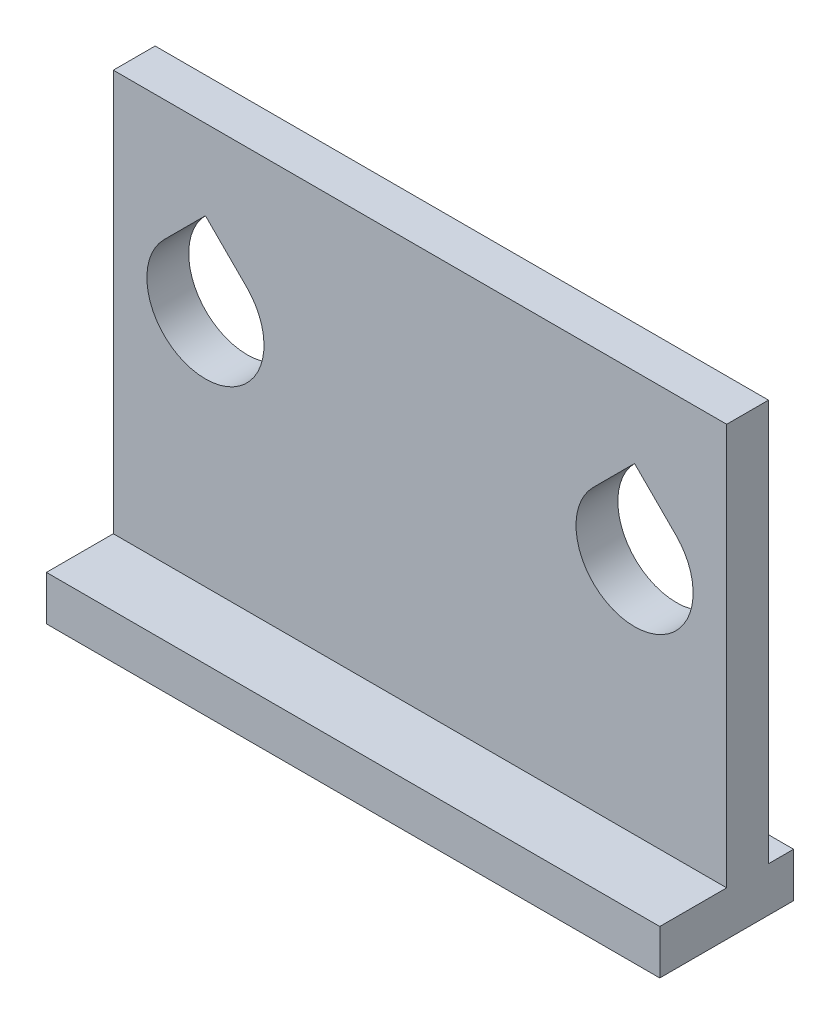
ISO-10303-21;
HEADER;
FILE_DESCRIPTION(('STEP AP214'),'2;1');
FILE_NAME('part.step','',(''),(''),'','','');
FILE_SCHEMA(('AUTOMOTIVE_DESIGN { 1 0 10303 214 1 1 1 1 }'));
ENDSEC;
DATA;
#1=APPLICATION_CONTEXT('core data for automotive mechanical design processes');
#2=APPLICATION_PROTOCOL_DEFINITION('international standard','automotive_design',2000,#1);
#3=PRODUCT_CONTEXT('',#1,'mechanical');
#4=PRODUCT('Part','Part','',(#3));
#5=PRODUCT_RELATED_PRODUCT_CATEGORY('part','',(#4));
#6=PRODUCT_DEFINITION_FORMATION('','',#4);
#7=PRODUCT_DEFINITION_CONTEXT('part definition',#1,'design');
#8=PRODUCT_DEFINITION('design','',#6,#7);
#9=PRODUCT_DEFINITION_SHAPE('','',#8);
#10=(LENGTH_UNIT() NAMED_UNIT(*) SI_UNIT(.MILLI.,.METRE.));
#11=(NAMED_UNIT(*) PLANE_ANGLE_UNIT() SI_UNIT($,.RADIAN.));
#12=(NAMED_UNIT(*) SI_UNIT($,.STERADIAN.) SOLID_ANGLE_UNIT());
#13=UNCERTAINTY_MEASURE_WITH_UNIT(LENGTH_MEASURE(1.E-05),#10,'distance_accuracy_value','');
#14=(GEOMETRIC_REPRESENTATION_CONTEXT(3) GLOBAL_UNCERTAINTY_ASSIGNED_CONTEXT((#13)) GLOBAL_UNIT_ASSIGNED_CONTEXT((#10,
#11,#12)) REPRESENTATION_CONTEXT('',''));
#15=CARTESIAN_POINT('',(0.,0.,0.));
#16=DIRECTION('',(0.,0.,1.));
#17=DIRECTION('',(1.,0.,0.));
#18=AXIS2_PLACEMENT_3D('',#15,#16,#17);
#19=CARTESIAN_POINT('',(0.,0.,7.5));
#20=DIRECTION('',(0.,1.,0.));
#21=DIRECTION('',(-1.,0.,0.));
#22=AXIS2_PLACEMENT_3D('',#19,#20,#21);
#23=PLANE('',#22);
#24=DIRECTION('',(0.,0.,-1.));
#25=VECTOR('',#24,1.);
#26=CARTESIAN_POINT('',(-55.,0.,7.5));
#27=LINE('',#26,#25);
#28=CARTESIAN_POINT('',(-55.,0.,19.5));
#29=VERTEX_POINT('',#28);
#30=CARTESIAN_POINT('',(-55.,0.,-4.5));
#31=VERTEX_POINT('',#30);
#32=EDGE_CURVE('E135',#29,#31,#27,.T.);
#33=ORIENTED_EDGE('',*,*,#32,.T.);
#34=DIRECTION('',(1.,0.,0.));
#35=VECTOR('',#34,1.);
#36=CARTESIAN_POINT('',(-55.,0.,-4.5));
#37=LINE('',#36,#35);
#38=CARTESIAN_POINT('',(55.,0.,-4.5));
#39=VERTEX_POINT('',#38);
#40=EDGE_CURVE('E166',#31,#39,#37,.T.);
#41=ORIENTED_EDGE('',*,*,#40,.T.);
#42=DIRECTION('',(0.,0.,-1.));
#43=VECTOR('',#42,1.);
#44=CARTESIAN_POINT('',(55.,0.,7.5));
#45=LINE('',#44,#43);
#46=CARTESIAN_POINT('',(55.,0.,19.5));
#47=VERTEX_POINT('',#46);
#48=EDGE_CURVE('E44',#47,#39,#45,.T.);
#49=ORIENTED_EDGE('',*,*,#48,.F.);
#50=DIRECTION('',(1.,0.,0.));
#51=VECTOR('',#50,1.);
#52=CARTESIAN_POINT('',(-55.,0.,19.5));
#53=LINE('',#52,#51);
#54=EDGE_CURVE('E151',#29,#47,#53,.T.);
#55=ORIENTED_EDGE('',*,*,#54,.F.);
#56=EDGE_LOOP('',(#33,#41,#49,#55));
#57=FACE_BOUND('',#56,.T.);
#58=ADVANCED_FACE('F36',(#57),#23,.F.);
#59=CARTESIAN_POINT('',(55.,0.,7.5));
#60=DIRECTION('',(-1.,0.,0.));
#61=DIRECTION('',(0.,0.,1.));
#62=AXIS2_PLACEMENT_3D('',#59,#60,#61);
#63=PLANE('',#62);
#64=DIRECTION('',(0.,1.,0.));
#65=VECTOR('',#64,1.);
#66=CARTESIAN_POINT('',(55.,0.,7.5));
#67=LINE('',#66,#65);
#68=CARTESIAN_POINT('',(55.,8.,7.5));
#69=VERTEX_POINT('',#68);
#70=CARTESIAN_POINT('',(55.,80.,7.5));
#71=VERTEX_POINT('',#70);
#72=EDGE_CURVE('E199',#69,#71,#67,.T.);
#73=ORIENTED_EDGE('',*,*,#72,.F.);
#74=DIRECTION('',(0.,0.,1.));
#75=VECTOR('',#74,1.);
#76=CARTESIAN_POINT('',(55.,8.,-4.5));
#77=LINE('',#76,#75);
#78=CARTESIAN_POINT('',(55.,8.,19.5));
#79=VERTEX_POINT('',#78);
#80=EDGE_CURVE('E174',#69,#79,#77,.T.);
#81=ORIENTED_EDGE('',*,*,#80,.T.);
#82=DIRECTION('',(0.,1.,0.));
#83=VECTOR('',#82,1.);
#84=CARTESIAN_POINT('',(55.,0.,19.5));
#85=LINE('',#84,#83);
#86=EDGE_CURVE('E155',#47,#79,#85,.T.);
#87=ORIENTED_EDGE('',*,*,#86,.F.);
#88=ORIENTED_EDGE('',*,*,#48,.T.);
#89=DIRECTION('',(0.,1.,0.));
#90=VECTOR('',#89,1.);
#91=CARTESIAN_POINT('',(55.,0.,-4.5));
#92=LINE('',#91,#90);
#93=CARTESIAN_POINT('',(55.,8.,-4.5));
#94=VERTEX_POINT('',#93);
#95=EDGE_CURVE('E168',#39,#94,#92,.T.);
#96=ORIENTED_EDGE('',*,*,#95,.T.);
#97=CARTESIAN_POINT('',(55.,8.,0.));
#98=VERTEX_POINT('',#97);
#99=EDGE_CURVE('E178',#94,#98,#77,.T.);
#100=ORIENTED_EDGE('',*,*,#99,.T.);
#101=DIRECTION('',(0.,1.,0.));
#102=VECTOR('',#101,1.);
#103=CARTESIAN_POINT('',(55.,0.,0.));
#104=LINE('',#103,#102);
#105=CARTESIAN_POINT('',(55.,80.,0.));
#106=VERTEX_POINT('',#105);
#107=EDGE_CURVE('E222',#98,#106,#104,.T.);
#108=ORIENTED_EDGE('',*,*,#107,.T.);
#109=DIRECTION('',(0.,0.,-1.));
#110=VECTOR('',#109,1.);
#111=CARTESIAN_POINT('',(55.,80.,7.5));
#112=LINE('',#111,#110);
#113=EDGE_CURVE('E230',#71,#106,#112,.T.);
#114=ORIENTED_EDGE('',*,*,#113,.F.);
#115=EDGE_LOOP('',(#73,#81,#87,#88,#96,#100,#108,#114));
#116=FACE_BOUND('',#115,.T.);
#117=ADVANCED_FACE('F285',(#116),#63,.F.);
#118=CARTESIAN_POINT('',(0.,80.,7.5));
#119=DIRECTION('',(0.,1.,0.));
#120=DIRECTION('',(-1.,0.,0.));
#121=AXIS2_PLACEMENT_3D('',#118,#119,#120);
#122=PLANE('',#121);
#123=DIRECTION('',(1.,0.,0.));
#124=VECTOR('',#123,1.);
#125=CARTESIAN_POINT('',(0.,80.,0.));
#126=LINE('',#125,#124);
#127=CARTESIAN_POINT('',(-55.,80.,0.));
#128=VERTEX_POINT('',#127);
#129=EDGE_CURVE('E224',#128,#106,#126,.T.);
#130=ORIENTED_EDGE('',*,*,#129,.F.);
#131=DIRECTION('',(0.,0.,-1.));
#132=VECTOR('',#131,1.);
#133=CARTESIAN_POINT('',(-55.,80.,7.5));
#134=LINE('',#133,#132);
#135=CARTESIAN_POINT('',(-55.,80.,7.5));
#136=VERTEX_POINT('',#135);
#137=EDGE_CURVE('E147',#136,#128,#134,.T.);
#138=ORIENTED_EDGE('',*,*,#137,.F.);
#139=DIRECTION('',(1.,0.,0.));
#140=VECTOR('',#139,1.);
#141=CARTESIAN_POINT('',(0.,80.,7.5));
#142=LINE('',#141,#140);
#143=EDGE_CURVE('E201',#136,#71,#142,.T.);
#144=ORIENTED_EDGE('',*,*,#143,.T.);
#145=ORIENTED_EDGE('',*,*,#113,.T.);
#146=EDGE_LOOP('',(#130,#138,#144,#145));
#147=FACE_BOUND('',#146,.T.);
#148=ADVANCED_FACE('F287',(#147),#122,.T.);
#149=CARTESIAN_POINT('',(-38.481,50.8,7.5));
#150=DIRECTION('',(0.,0.,-1.));
#151=DIRECTION('',(-1.,0.,0.));
#152=AXIS2_PLACEMENT_3D('',#149,#150,#151);
#153=CYLINDRICAL_SURFACE('',#152,10.5);
#154=CARTESIAN_POINT('',(-38.481,50.8,0.));
#155=DIRECTION('',(0.,0.,1.));
#156=DIRECTION('',(1.,0.,0.));
#157=AXIS2_PLACEMENT_3D('',#154,#155,#156);
#158=CIRCLE('',#157,10.5);
#159=CARTESIAN_POINT('',(-45.9056212024588,58.2246212024587,0.));
#160=VERTEX_POINT('',#159);
#161=CARTESIAN_POINT('',(-31.0563787975412,58.2246212024587,0.));
#162=VERTEX_POINT('',#161);
#163=EDGE_CURVE('E213',#160,#162,#158,.T.);
#164=ORIENTED_EDGE('',*,*,#163,.F.);
#165=DIRECTION('',(0.,0.,-1.));
#166=VECTOR('',#165,1.);
#167=CARTESIAN_POINT('',(-45.9056212024588,58.2246212024587,7.5));
#168=LINE('',#167,#166);
#169=CARTESIAN_POINT('',(-45.9056212024588,58.2246212024587,7.5));
#170=VERTEX_POINT('',#169);
#171=EDGE_CURVE('E148',#170,#160,#168,.T.);
#172=ORIENTED_EDGE('',*,*,#171,.F.);
#173=CARTESIAN_POINT('',(-38.481,50.8,7.5));
#174=DIRECTION('',(0.,0.,1.));
#175=DIRECTION('',(1.,0.,0.));
#176=AXIS2_PLACEMENT_3D('',#173,#174,#175);
#177=CIRCLE('',#176,10.5);
#178=CARTESIAN_POINT('',(-31.0563787975412,58.2246212024587,7.5));
#179=VERTEX_POINT('',#178);
#180=EDGE_CURVE('E191',#170,#179,#177,.T.);
#181=ORIENTED_EDGE('',*,*,#180,.T.);
#182=DIRECTION('',(0.,0.,-1.));
#183=VECTOR('',#182,1.);
#184=CARTESIAN_POINT('',(-31.0563787975412,58.2246212024587,7.5));
#185=LINE('',#184,#183);
#186=EDGE_CURVE('E234',#179,#162,#185,.T.);
#187=ORIENTED_EDGE('',*,*,#186,.T.);
#188=EDGE_LOOP('',(#164,#172,#181,#187));
#189=FACE_BOUND('',#188,.T.);
#190=ADVANCED_FACE('F271',(#189),#153,.F.);
#191=CARTESIAN_POINT('',(-52.0651212024589,52.0651212024586,7.5));
#192=DIRECTION('',(-0.707106781186549,0.707106781186546,0.));
#193=DIRECTION('',(-0.707106781186546,-0.707106781186549,0.));
#194=AXIS2_PLACEMENT_3D('',#191,#192,#193);
#195=PLANE('',#194);
#196=DIRECTION('',(0.707106781186546,0.707106781186549,0.));
#197=VECTOR('',#196,1.);
#198=CARTESIAN_POINT('',(-52.0651212024589,52.0651212024586,0.));
#199=LINE('',#198,#197);
#200=CARTESIAN_POINT('',(-38.481,65.6492424049175,0.));
#201=VERTEX_POINT('',#200);
#202=EDGE_CURVE('E216',#160,#201,#199,.T.);
#203=ORIENTED_EDGE('',*,*,#202,.T.);
#204=DIRECTION('',(0.,0.,-1.));
#205=VECTOR('',#204,1.);
#206=CARTESIAN_POINT('',(-38.481,65.6492424049175,7.5));
#207=LINE('',#206,#205);
#208=CARTESIAN_POINT('',(-38.481,65.6492424049175,7.5));
#209=VERTEX_POINT('',#208);
#210=EDGE_CURVE('E236',#209,#201,#207,.T.);
#211=ORIENTED_EDGE('',*,*,#210,.F.);
#212=DIRECTION('',(0.707106781186546,0.707106781186549,0.));
#213=VECTOR('',#212,1.);
#214=CARTESIAN_POINT('',(-52.0651212024589,52.0651212024586,7.5));
#215=LINE('',#214,#213);
#216=EDGE_CURVE('E194',#170,#209,#215,.T.);
#217=ORIENTED_EDGE('',*,*,#216,.F.);
#218=ORIENTED_EDGE('',*,*,#171,.T.);
#219=EDGE_LOOP('',(#203,#211,#217,#218));
#220=FACE_BOUND('',#219,.T.);
#221=ADVANCED_FACE('F274',(#220),#195,.F.);
#222=CARTESIAN_POINT('',(38.481,50.8,7.5));
#223=DIRECTION('',(0.,0.,-1.));
#224=DIRECTION('',(-1.,0.,0.));
#225=AXIS2_PLACEMENT_3D('',#222,#223,#224);
#226=CYLINDRICAL_SURFACE('',#225,10.5);
#227=CARTESIAN_POINT('',(38.481,50.8,0.));
#228=DIRECTION('',(0.,0.,1.));
#229=DIRECTION('',(1.,0.,0.));
#230=AXIS2_PLACEMENT_3D('',#227,#228,#229);
#231=CIRCLE('',#230,10.5);
#232=CARTESIAN_POINT('',(31.0563787975413,58.2246212024588,0.));
#233=VERTEX_POINT('',#232);
#234=CARTESIAN_POINT('',(45.9056212024588,58.2246212024587,0.));
#235=VERTEX_POINT('',#234);
#236=EDGE_CURVE('E182',#233,#235,#231,.T.);
#237=ORIENTED_EDGE('',*,*,#236,.F.);
#238=DIRECTION('',(0.,0.,-1.));
#239=VECTOR('',#238,1.);
#240=CARTESIAN_POINT('',(31.0563787975413,58.2246212024588,7.5));
#241=LINE('',#240,#239);
#242=CARTESIAN_POINT('',(31.0563787975413,58.2246212024588,7.5));
#243=VERTEX_POINT('',#242);
#244=EDGE_CURVE('E237',#243,#233,#241,.T.);
#245=ORIENTED_EDGE('',*,*,#244,.F.);
#246=CARTESIAN_POINT('',(38.481,50.8,7.5));
#247=DIRECTION('',(0.,0.,1.));
#248=DIRECTION('',(1.,0.,0.));
#249=AXIS2_PLACEMENT_3D('',#246,#247,#248);
#250=CIRCLE('',#249,10.5);
#251=CARTESIAN_POINT('',(45.9056212024588,58.2246212024587,7.5));
#252=VERTEX_POINT('',#251);
#253=EDGE_CURVE('E183',#243,#252,#250,.T.);
#254=ORIENTED_EDGE('',*,*,#253,.T.);
#255=DIRECTION('',(0.,0.,-1.));
#256=VECTOR('',#255,1.);
#257=CARTESIAN_POINT('',(45.9056212024588,58.2246212024587,7.5));
#258=LINE('',#257,#256);
#259=EDGE_CURVE('E205',#252,#235,#258,.T.);
#260=ORIENTED_EDGE('',*,*,#259,.T.);
#261=EDGE_LOOP('',(#237,#245,#254,#260));
#262=FACE_BOUND('',#261,.T.);
#263=ADVANCED_FACE('F38',(#262),#226,.F.);
#264=CARTESIAN_POINT('',(-13.5841212024589,13.5841212024591,7.5));
#265=DIRECTION('',(-0.707106781186544,0.707106781186551,0.));
#266=DIRECTION('',(-0.707106781186551,-0.707106781186544,0.));
#267=AXIS2_PLACEMENT_3D('',#264,#265,#266);
#268=PLANE('',#267);
#269=DIRECTION('',(0.707106781186551,0.707106781186544,0.));
#270=VECTOR('',#269,1.);
#271=CARTESIAN_POINT('',(-13.5841212024589,13.5841212024591,0.));
#272=LINE('',#271,#270);
#273=CARTESIAN_POINT('',(38.4810000000001,65.6492424049175,0.));
#274=VERTEX_POINT('',#273);
#275=EDGE_CURVE('E208',#233,#274,#272,.T.);
#276=ORIENTED_EDGE('',*,*,#275,.T.);
#277=DIRECTION('',(0.,0.,-1.));
#278=VECTOR('',#277,1.);
#279=CARTESIAN_POINT('',(38.4810000000001,65.6492424049175,7.5));
#280=LINE('',#279,#278);
#281=CARTESIAN_POINT('',(38.4810000000001,65.6492424049175,7.5));
#282=VERTEX_POINT('',#281);
#283=EDGE_CURVE('E242',#282,#274,#280,.T.);
#284=ORIENTED_EDGE('',*,*,#283,.F.);
#285=DIRECTION('',(0.707106781186551,0.707106781186544,0.));
#286=VECTOR('',#285,1.);
#287=CARTESIAN_POINT('',(-13.5841212024589,13.5841212024591,7.5));
#288=LINE('',#287,#286);
#289=EDGE_CURVE('E186',#243,#282,#288,.T.);
#290=ORIENTED_EDGE('',*,*,#289,.F.);
#291=ORIENTED_EDGE('',*,*,#244,.T.);
#292=EDGE_LOOP('',(#276,#284,#290,#291));
#293=FACE_BOUND('',#292,.T.);
#294=ADVANCED_FACE('F247',(#293),#268,.F.);
#295=CARTESIAN_POINT('',(13.5841212024587,13.5841212024586,7.5));
#296=DIRECTION('',(0.707106781186549,0.707106781186546,0.));
#297=DIRECTION('',(-0.707106781186546,0.707106781186549,0.));
#298=AXIS2_PLACEMENT_3D('',#295,#296,#297);
#299=PLANE('',#298);
#300=DIRECTION('',(0.707106781186546,-0.707106781186549,0.));
#301=VECTOR('',#300,1.);
#302=CARTESIAN_POINT('',(13.5841212024587,13.5841212024586,0.));
#303=LINE('',#302,#301);
#304=EDGE_CURVE('E219',#201,#162,#303,.T.);
#305=ORIENTED_EDGE('',*,*,#304,.T.);
#306=ORIENTED_EDGE('',*,*,#186,.F.);
#307=DIRECTION('',(0.707106781186546,-0.707106781186549,0.));
#308=VECTOR('',#307,1.);
#309=CARTESIAN_POINT('',(13.5841212024587,13.5841212024586,7.5));
#310=LINE('',#309,#308);
#311=EDGE_CURVE('E197',#209,#179,#310,.T.);
#312=ORIENTED_EDGE('',*,*,#311,.F.);
#313=ORIENTED_EDGE('',*,*,#210,.T.);
#314=EDGE_LOOP('',(#305,#306,#312,#313));
#315=FACE_BOUND('',#314,.T.);
#316=ADVANCED_FACE('F276',(#315),#299,.F.);
#317=CARTESIAN_POINT('',(52.0651212024591,52.0651212024583,7.5));
#318=DIRECTION('',(0.707106781186553,0.707106781186542,0.));
#319=DIRECTION('',(-0.707106781186542,0.707106781186553,0.));
#320=AXIS2_PLACEMENT_3D('',#317,#318,#319);
#321=PLANE('',#320);
#322=DIRECTION('',(0.707106781186542,-0.707106781186553,0.));
#323=VECTOR('',#322,1.);
#324=CARTESIAN_POINT('',(52.0651212024591,52.0651212024583,0.));
#325=LINE('',#324,#323);
#326=EDGE_CURVE('E210',#274,#235,#325,.T.);
#327=ORIENTED_EDGE('',*,*,#326,.T.);
#328=ORIENTED_EDGE('',*,*,#259,.F.);
#329=DIRECTION('',(0.707106781186542,-0.707106781186553,0.));
#330=VECTOR('',#329,1.);
#331=CARTESIAN_POINT('',(52.0651212024591,52.0651212024583,7.5));
#332=LINE('',#331,#330);
#333=EDGE_CURVE('E189',#282,#252,#332,.T.);
#334=ORIENTED_EDGE('',*,*,#333,.F.);
#335=ORIENTED_EDGE('',*,*,#283,.T.);
#336=EDGE_LOOP('',(#327,#328,#334,#335));
#337=FACE_BOUND('',#336,.T.);
#338=ADVANCED_FACE('F259',(#337),#321,.F.);
#339=CARTESIAN_POINT('',(-55.,0.,7.5));
#340=DIRECTION('',(-1.,0.,0.));
#341=DIRECTION('',(0.,0.,1.));
#342=AXIS2_PLACEMENT_3D('',#339,#340,#341);
#343=PLANE('',#342);
#344=DIRECTION('',(0.,1.,0.));
#345=VECTOR('',#344,1.);
#346=CARTESIAN_POINT('',(-55.,0.,0.));
#347=LINE('',#346,#345);
#348=CARTESIAN_POINT('',(-55.,8.,0.));
#349=VERTEX_POINT('',#348);
#350=EDGE_CURVE('E187',#349,#128,#347,.T.);
#351=ORIENTED_EDGE('',*,*,#350,.F.);
#352=DIRECTION('',(0.,0.,1.));
#353=VECTOR('',#352,1.);
#354=CARTESIAN_POINT('',(-55.,8.,-4.5));
#355=LINE('',#354,#353);
#356=CARTESIAN_POINT('',(-55.,8.,-4.5));
#357=VERTEX_POINT('',#356);
#358=EDGE_CURVE('E175',#357,#349,#355,.T.);
#359=ORIENTED_EDGE('',*,*,#358,.F.);
#360=DIRECTION('',(0.,-1.,0.));
#361=VECTOR('',#360,1.);
#362=CARTESIAN_POINT('',(-55.,0.,-4.5));
#363=LINE('',#362,#361);
#364=EDGE_CURVE('E143',#357,#31,#363,.T.);
#365=ORIENTED_EDGE('',*,*,#364,.T.);
#366=ORIENTED_EDGE('',*,*,#32,.F.);
#367=DIRECTION('',(0.,-1.,0.));
#368=VECTOR('',#367,1.);
#369=CARTESIAN_POINT('',(-55.,0.,19.5));
#370=LINE('',#369,#368);
#371=CARTESIAN_POINT('',(-55.,8.,19.5));
#372=VERTEX_POINT('',#371);
#373=EDGE_CURVE('E141',#372,#29,#370,.T.);
#374=ORIENTED_EDGE('',*,*,#373,.F.);
#375=CARTESIAN_POINT('',(-55.,8.,7.5));
#376=VERTEX_POINT('',#375);
#377=EDGE_CURVE('E177',#376,#372,#355,.T.);
#378=ORIENTED_EDGE('',*,*,#377,.F.);
#379=DIRECTION('',(0.,1.,0.));
#380=VECTOR('',#379,1.);
#381=CARTESIAN_POINT('',(-55.,0.,7.5));
#382=LINE('',#381,#380);
#383=EDGE_CURVE('E51',#376,#136,#382,.T.);
#384=ORIENTED_EDGE('',*,*,#383,.T.);
#385=ORIENTED_EDGE('',*,*,#137,.T.);
#386=EDGE_LOOP('',(#351,#359,#365,#366,#374,#378,#384,#385));
#387=FACE_BOUND('',#386,.T.);
#388=ADVANCED_FACE('F138',(#387),#343,.T.);
#389=CARTESIAN_POINT('',(0.,0.,7.5));
#390=DIRECTION('',(0.,0.,1.));
#391=DIRECTION('',(1.,0.,0.));
#392=AXIS2_PLACEMENT_3D('',#389,#390,#391);
#393=PLANE('',#392);
#394=DIRECTION('',(-1.,0.,0.));
#395=VECTOR('',#394,1.);
#396=CARTESIAN_POINT('',(0.,8.,7.5));
#397=LINE('',#396,#395);
#398=EDGE_CURVE('E55',#69,#376,#397,.T.);
#399=ORIENTED_EDGE('',*,*,#398,.F.);
#400=ORIENTED_EDGE('',*,*,#72,.T.);
#401=ORIENTED_EDGE('',*,*,#143,.F.);
#402=ORIENTED_EDGE('',*,*,#383,.F.);
#403=EDGE_LOOP('',(#399,#400,#401,#402));
#404=FACE_BOUND('',#403,.T.);
#405=ORIENTED_EDGE('',*,*,#253,.F.);
#406=ORIENTED_EDGE('',*,*,#289,.T.);
#407=ORIENTED_EDGE('',*,*,#333,.T.);
#408=EDGE_LOOP('',(#405,#406,#407));
#409=FACE_BOUND('',#408,.T.);
#410=ORIENTED_EDGE('',*,*,#180,.F.);
#411=ORIENTED_EDGE('',*,*,#216,.T.);
#412=ORIENTED_EDGE('',*,*,#311,.T.);
#413=EDGE_LOOP('',(#410,#411,#412));
#414=FACE_BOUND('',#413,.T.);
#415=ADVANCED_FACE('F261',(#404,#409,#414),#393,.T.);
#416=CARTESIAN_POINT('',(0.,0.,0.));
#417=DIRECTION('',(0.,0.,1.));
#418=DIRECTION('',(1.,0.,0.));
#419=AXIS2_PLACEMENT_3D('',#416,#417,#418);
#420=PLANE('',#419);
#421=ORIENTED_EDGE('',*,*,#236,.T.);
#422=ORIENTED_EDGE('',*,*,#326,.F.);
#423=ORIENTED_EDGE('',*,*,#275,.F.);
#424=EDGE_LOOP('',(#421,#422,#423));
#425=FACE_BOUND('',#424,.T.);
#426=ORIENTED_EDGE('',*,*,#163,.T.);
#427=ORIENTED_EDGE('',*,*,#304,.F.);
#428=ORIENTED_EDGE('',*,*,#202,.F.);
#429=EDGE_LOOP('',(#426,#427,#428));
#430=FACE_BOUND('',#429,.T.);
#431=ORIENTED_EDGE('',*,*,#107,.F.);
#432=DIRECTION('',(-1.,0.,0.));
#433=VECTOR('',#432,1.);
#434=CARTESIAN_POINT('',(0.,8.,0.));
#435=LINE('',#434,#433);
#436=EDGE_CURVE('E11',#98,#349,#435,.T.);
#437=ORIENTED_EDGE('',*,*,#436,.T.);
#438=ORIENTED_EDGE('',*,*,#350,.T.);
#439=ORIENTED_EDGE('',*,*,#129,.T.);
#440=EDGE_LOOP('',(#431,#437,#438,#439));
#441=FACE_BOUND('',#440,.T.);
#442=ADVANCED_FACE('F254',(#425,#430,#441),#420,.F.);
#443=CARTESIAN_POINT('',(0.,0.,-4.5));
#444=DIRECTION('',(0.,0.,-1.));
#445=DIRECTION('',(-1.,0.,0.));
#446=AXIS2_PLACEMENT_3D('',#443,#444,#445);
#447=PLANE('',#446);
#448=ORIENTED_EDGE('',*,*,#364,.F.);
#449=DIRECTION('',(-1.,0.,0.));
#450=VECTOR('',#449,1.);
#451=CARTESIAN_POINT('',(-55.,8.,-4.5));
#452=LINE('',#451,#450);
#453=EDGE_CURVE('E171',#94,#357,#452,.T.);
#454=ORIENTED_EDGE('',*,*,#453,.F.);
#455=ORIENTED_EDGE('',*,*,#95,.F.);
#456=ORIENTED_EDGE('',*,*,#40,.F.);
#457=EDGE_LOOP('',(#448,#454,#455,#456));
#458=FACE_BOUND('',#457,.T.);
#459=ADVANCED_FACE('F279',(#458),#447,.T.);
#460=CARTESIAN_POINT('',(-55.,8.,-4.5));
#461=DIRECTION('',(0.,1.,0.));
#462=DIRECTION('',(0.,0.,1.));
#463=AXIS2_PLACEMENT_3D('',#460,#461,#462);
#464=PLANE('',#463);
#465=ORIENTED_EDGE('',*,*,#436,.F.);
#466=ORIENTED_EDGE('',*,*,#99,.F.);
#467=ORIENTED_EDGE('',*,*,#453,.T.);
#468=ORIENTED_EDGE('',*,*,#358,.T.);
#469=EDGE_LOOP('',(#465,#466,#467,#468));
#470=FACE_BOUND('',#469,.T.);
#471=ADVANCED_FACE('F296',(#470),#464,.T.);
#472=ORIENTED_EDGE('',*,*,#80,.F.);
#473=ORIENTED_EDGE('',*,*,#398,.T.);
#474=ORIENTED_EDGE('',*,*,#377,.T.);
#475=DIRECTION('',(-1.,0.,0.));
#476=VECTOR('',#475,1.);
#477=CARTESIAN_POINT('',(-55.,8.,19.5));
#478=LINE('',#477,#476);
#479=EDGE_CURVE('E160',#79,#372,#478,.T.);
#480=ORIENTED_EDGE('',*,*,#479,.F.);
#481=EDGE_LOOP('',(#472,#473,#474,#480));
#482=FACE_BOUND('',#481,.T.);
#483=ADVANCED_FACE('F291',(#482),#464,.T.);
#484=CARTESIAN_POINT('',(0.,0.,19.5));
#485=DIRECTION('',(0.,0.,-1.));
#486=DIRECTION('',(-1.,0.,0.));
#487=AXIS2_PLACEMENT_3D('',#484,#485,#486);
#488=PLANE('',#487);
#489=ORIENTED_EDGE('',*,*,#373,.T.);
#490=ORIENTED_EDGE('',*,*,#54,.T.);
#491=ORIENTED_EDGE('',*,*,#86,.T.);
#492=ORIENTED_EDGE('',*,*,#479,.T.);
#493=EDGE_LOOP('',(#489,#490,#491,#492));
#494=FACE_BOUND('',#493,.T.);
#495=ADVANCED_FACE('F158',(#494),#488,.F.);
#496=CLOSED_SHELL('',(#58,#117,#148,#190,#221,#263,#294,#316,#338,#388,#415,#442,#459,#471,#483,#495));
#497=MANIFOLD_SOLID_BREP('B2',#496);
#498=ADVANCED_BREP_SHAPE_REPRESENTATION('',(#18,#497),#14);
#499=SHAPE_DEFINITION_REPRESENTATION(#9,#498);
ENDSEC;
END-ISO-10303-21;
